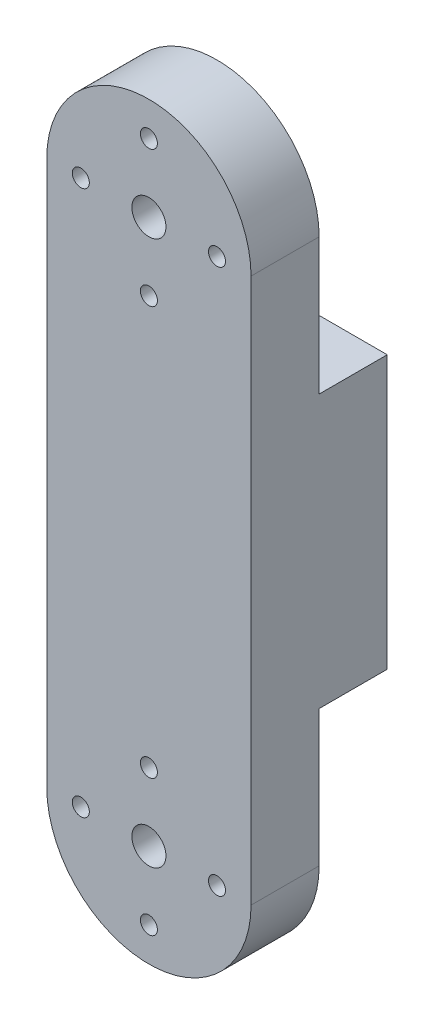
ISO-10303-21;
HEADER;
FILE_DESCRIPTION(('STEP AP214'),'2;1');
FILE_NAME('part.step','',(''),(''),'','','');
FILE_SCHEMA(('AUTOMOTIVE_DESIGN { 1 0 10303 214 1 1 1 1 }'));
ENDSEC;
DATA;
#1=APPLICATION_CONTEXT('core data for automotive mechanical design processes');
#2=APPLICATION_PROTOCOL_DEFINITION('international standard','automotive_design',2000,#1);
#3=PRODUCT_CONTEXT('',#1,'mechanical');
#4=PRODUCT('Part','Part','',(#3));
#5=PRODUCT_RELATED_PRODUCT_CATEGORY('part','',(#4));
#6=PRODUCT_DEFINITION_FORMATION('','',#4);
#7=PRODUCT_DEFINITION_CONTEXT('part definition',#1,'design');
#8=PRODUCT_DEFINITION('design','',#6,#7);
#9=PRODUCT_DEFINITION_SHAPE('','',#8);
#10=(LENGTH_UNIT() NAMED_UNIT(*) SI_UNIT(.MILLI.,.METRE.));
#11=(NAMED_UNIT(*) PLANE_ANGLE_UNIT() SI_UNIT($,.RADIAN.));
#12=(NAMED_UNIT(*) SI_UNIT($,.STERADIAN.) SOLID_ANGLE_UNIT());
#13=UNCERTAINTY_MEASURE_WITH_UNIT(LENGTH_MEASURE(1.E-05),#10,'distance_accuracy_value','');
#14=(GEOMETRIC_REPRESENTATION_CONTEXT(3) GLOBAL_UNCERTAINTY_ASSIGNED_CONTEXT((#13)) GLOBAL_UNIT_ASSIGNED_CONTEXT((#10,
#11,#12)) REPRESENTATION_CONTEXT('',''));
#15=CARTESIAN_POINT('',(0.,0.,0.));
#16=DIRECTION('',(0.,0.,1.));
#17=DIRECTION('',(1.,0.,0.));
#18=AXIS2_PLACEMENT_3D('',#15,#16,#17);
#19=CARTESIAN_POINT('',(0.,50.8,25.4));
#20=DIRECTION('',(0.,0.,-1.));
#21=DIRECTION('',(-1.,0.,0.));
#22=AXIS2_PLACEMENT_3D('',#19,#20,#21);
#23=PLANE('',#22);
#24=CARTESIAN_POINT('',(0.,50.8,25.4));
#25=DIRECTION('',(0.,0.,1.));
#26=DIRECTION('',(-1.,0.,0.));
#27=AXIS2_PLACEMENT_3D('',#24,#25,#26);
#28=CIRCLE('',#27,19.05);
#29=CARTESIAN_POINT('',(19.05,50.8,25.4));
#30=VERTEX_POINT('',#29);
#31=CARTESIAN_POINT('',(-19.05,50.8,25.4));
#32=VERTEX_POINT('',#31);
#33=EDGE_CURVE('E125',#30,#32,#28,.T.);
#34=ORIENTED_EDGE('',*,*,#33,.T.);
#35=DIRECTION('',(0.,-1.,0.));
#36=VECTOR('',#35,1.);
#37=CARTESIAN_POINT('',(-19.05,50.8,25.4));
#38=LINE('',#37,#36);
#39=CARTESIAN_POINT('',(-19.05,-50.8,25.4));
#40=VERTEX_POINT('',#39);
#41=EDGE_CURVE('E118',#32,#40,#38,.T.);
#42=ORIENTED_EDGE('',*,*,#41,.T.);
#43=CARTESIAN_POINT('',(0.,-50.8,25.4));
#44=DIRECTION('',(0.,0.,1.));
#45=DIRECTION('',(1.,0.,0.));
#46=AXIS2_PLACEMENT_3D('',#43,#44,#45);
#47=CIRCLE('',#46,19.05);
#48=CARTESIAN_POINT('',(19.05,-50.8,25.4));
#49=VERTEX_POINT('',#48);
#50=EDGE_CURVE('E124',#40,#49,#47,.T.);
#51=ORIENTED_EDGE('',*,*,#50,.T.);
#52=DIRECTION('',(0.,1.,0.));
#53=VECTOR('',#52,1.);
#54=CARTESIAN_POINT('',(19.05,50.8,25.4));
#55=LINE('',#54,#53);
#56=EDGE_CURVE('E129',#49,#30,#55,.T.);
#57=ORIENTED_EDGE('',*,*,#56,.T.);
#58=EDGE_LOOP('',(#34,#42,#51,#57));
#59=FACE_BOUND('',#58,.T.);
#60=CARTESIAN_POINT('',(0.,50.8,25.4));
#61=DIRECTION('',(0.,0.,1.));
#62=DIRECTION('',(1.,0.,0.));
#63=AXIS2_PLACEMENT_3D('',#60,#61,#62);
#64=CIRCLE('',#63,3.175);
#65=CARTESIAN_POINT('',(3.17499999999998,50.8,25.4));
#66=VERTEX_POINT('',#65);
#67=EDGE_CURVE('E136',#66,#66,#64,.T.);
#68=ORIENTED_EDGE('',*,*,#67,.F.);
#69=EDGE_LOOP('',(#68));
#70=FACE_BOUND('',#69,.T.);
#71=CARTESIAN_POINT('',(0.,-50.8,25.4));
#72=DIRECTION('',(0.,0.,1.));
#73=DIRECTION('',(1.,0.,0.));
#74=AXIS2_PLACEMENT_3D('',#71,#72,#73);
#75=CIRCLE('',#74,3.175);
#76=CARTESIAN_POINT('',(3.17500000000001,-50.8,25.4));
#77=VERTEX_POINT('',#76);
#78=EDGE_CURVE('E228',#77,#77,#75,.T.);
#79=ORIENTED_EDGE('',*,*,#78,.F.);
#80=EDGE_LOOP('',(#79));
#81=FACE_BOUND('',#80,.T.);
#82=CARTESIAN_POINT('',(0.,63.5,25.4));
#83=DIRECTION('',(0.,0.,1.));
#84=DIRECTION('',(1.,0.,0.));
#85=AXIS2_PLACEMENT_3D('',#82,#83,#84);
#86=CIRCLE('',#85,1.5875);
#87=CARTESIAN_POINT('',(1.5875,63.5,25.4));
#88=VERTEX_POINT('',#87);
#89=EDGE_CURVE('E226',#88,#88,#86,.T.);
#90=ORIENTED_EDGE('',*,*,#89,.F.);
#91=EDGE_LOOP('',(#90));
#92=FACE_BOUND('',#91,.T.);
#93=CARTESIAN_POINT('',(-12.7,50.8,25.4));
#94=DIRECTION('',(0.,0.,1.));
#95=DIRECTION('',(1.,0.,0.));
#96=AXIS2_PLACEMENT_3D('',#93,#94,#95);
#97=CIRCLE('',#96,1.5875);
#98=CARTESIAN_POINT('',(-11.1125,50.8,25.4));
#99=VERTEX_POINT('',#98);
#100=EDGE_CURVE('E223',#99,#99,#97,.T.);
#101=ORIENTED_EDGE('',*,*,#100,.F.);
#102=EDGE_LOOP('',(#101));
#103=FACE_BOUND('',#102,.T.);
#104=CARTESIAN_POINT('',(0.,38.1,25.4));
#105=DIRECTION('',(0.,0.,1.));
#106=DIRECTION('',(1.,0.,0.));
#107=AXIS2_PLACEMENT_3D('',#104,#105,#106);
#108=CIRCLE('',#107,1.5875);
#109=CARTESIAN_POINT('',(1.5875,38.1,25.4));
#110=VERTEX_POINT('',#109);
#111=EDGE_CURVE('E220',#110,#110,#108,.T.);
#112=ORIENTED_EDGE('',*,*,#111,.F.);
#113=EDGE_LOOP('',(#112));
#114=FACE_BOUND('',#113,.T.);
#115=CARTESIAN_POINT('',(12.7,50.8,25.4));
#116=DIRECTION('',(0.,0.,1.));
#117=DIRECTION('',(1.,0.,0.));
#118=AXIS2_PLACEMENT_3D('',#115,#116,#117);
#119=CIRCLE('',#118,1.5875);
#120=CARTESIAN_POINT('',(14.2875,50.8,25.4));
#121=VERTEX_POINT('',#120);
#122=EDGE_CURVE('E217',#121,#121,#119,.T.);
#123=ORIENTED_EDGE('',*,*,#122,.F.);
#124=EDGE_LOOP('',(#123));
#125=FACE_BOUND('',#124,.T.);
#126=CARTESIAN_POINT('',(-12.7,-50.8,25.4));
#127=DIRECTION('',(0.,0.,1.));
#128=DIRECTION('',(1.,0.,0.));
#129=AXIS2_PLACEMENT_3D('',#126,#127,#128);
#130=CIRCLE('',#129,1.5875);
#131=CARTESIAN_POINT('',(-11.1125,-50.8,25.4));
#132=VERTEX_POINT('',#131);
#133=EDGE_CURVE('E214',#132,#132,#130,.T.);
#134=ORIENTED_EDGE('',*,*,#133,.F.);
#135=EDGE_LOOP('',(#134));
#136=FACE_BOUND('',#135,.T.);
#137=CARTESIAN_POINT('',(0.,-38.1,25.4));
#138=DIRECTION('',(0.,0.,1.));
#139=DIRECTION('',(1.,0.,0.));
#140=AXIS2_PLACEMENT_3D('',#137,#138,#139);
#141=CIRCLE('',#140,1.5875);
#142=CARTESIAN_POINT('',(1.5875,-38.1,25.4));
#143=VERTEX_POINT('',#142);
#144=EDGE_CURVE('E211',#143,#143,#141,.T.);
#145=ORIENTED_EDGE('',*,*,#144,.F.);
#146=EDGE_LOOP('',(#145));
#147=FACE_BOUND('',#146,.T.);
#148=CARTESIAN_POINT('',(12.7,-50.8,25.4));
#149=DIRECTION('',(0.,0.,1.));
#150=DIRECTION('',(1.,0.,0.));
#151=AXIS2_PLACEMENT_3D('',#148,#149,#150);
#152=CIRCLE('',#151,1.5875);
#153=CARTESIAN_POINT('',(14.2875,-50.8,25.4));
#154=VERTEX_POINT('',#153);
#155=EDGE_CURVE('E208',#154,#154,#152,.T.);
#156=ORIENTED_EDGE('',*,*,#155,.F.);
#157=EDGE_LOOP('',(#156));
#158=FACE_BOUND('',#157,.T.);
#159=CARTESIAN_POINT('',(0.,-63.5,25.4));
#160=DIRECTION('',(0.,0.,1.));
#161=DIRECTION('',(1.,0.,0.));
#162=AXIS2_PLACEMENT_3D('',#159,#160,#161);
#163=CIRCLE('',#162,1.5875);
#164=CARTESIAN_POINT('',(1.58750000000001,-63.5,25.4));
#165=VERTEX_POINT('',#164);
#166=EDGE_CURVE('E104',#165,#165,#163,.T.);
#167=ORIENTED_EDGE('',*,*,#166,.F.);
#168=EDGE_LOOP('',(#167));
#169=FACE_BOUND('',#168,.T.);
#170=ADVANCED_FACE('F33',(#59,#70,#81,#92,#103,#114,#125,#136,#147,#158,#169),#23,.F.);
#171=CARTESIAN_POINT('',(0.,50.8,0.));
#172=DIRECTION('',(0.,0.,-1.));
#173=DIRECTION('',(-1.,0.,0.));
#174=AXIS2_PLACEMENT_3D('',#171,#172,#173);
#175=PLANE('',#174);
#176=DIRECTION('',(1.,0.,0.));
#177=VECTOR('',#176,1.);
#178=CARTESIAN_POINT('',(-19.051,25.4,0.));
#179=LINE('',#178,#177);
#180=CARTESIAN_POINT('',(-19.05,25.4,0.));
#181=VERTEX_POINT('',#180);
#182=CARTESIAN_POINT('',(19.05,25.4,0.));
#183=VERTEX_POINT('',#182);
#184=EDGE_CURVE('E105',#181,#183,#179,.T.);
#185=ORIENTED_EDGE('',*,*,#184,.T.);
#186=DIRECTION('',(0.,1.,0.));
#187=VECTOR('',#186,1.);
#188=CARTESIAN_POINT('',(19.05,50.8,0.));
#189=LINE('',#188,#187);
#190=CARTESIAN_POINT('',(19.05,-25.4,0.));
#191=VERTEX_POINT('',#190);
#192=EDGE_CURVE('E130',#191,#183,#189,.T.);
#193=ORIENTED_EDGE('',*,*,#192,.F.);
#194=DIRECTION('',(1.,0.,0.));
#195=VECTOR('',#194,1.);
#196=CARTESIAN_POINT('',(-19.051,-25.4,0.));
#197=LINE('',#196,#195);
#198=CARTESIAN_POINT('',(-19.05,-25.4,0.));
#199=VERTEX_POINT('',#198);
#200=EDGE_CURVE('E56',#199,#191,#197,.T.);
#201=ORIENTED_EDGE('',*,*,#200,.F.);
#202=DIRECTION('',(0.,-1.,0.));
#203=VECTOR('',#202,1.);
#204=CARTESIAN_POINT('',(-19.05,50.8,0.));
#205=LINE('',#204,#203);
#206=EDGE_CURVE('E133',#181,#199,#205,.T.);
#207=ORIENTED_EDGE('',*,*,#206,.F.);
#208=EDGE_LOOP('',(#185,#193,#201,#207));
#209=FACE_BOUND('',#208,.T.);
#210=ADVANCED_FACE('F238',(#209),#175,.T.);
#211=CARTESIAN_POINT('',(0.,50.8,25.4));
#212=DIRECTION('',(0.,0.,-1.));
#213=DIRECTION('',(-1.,0.,0.));
#214=AXIS2_PLACEMENT_3D('',#211,#212,#213);
#215=CYLINDRICAL_SURFACE('',#214,19.05);
#216=DIRECTION('',(0.,0.,-1.));
#217=VECTOR('',#216,1.);
#218=CARTESIAN_POINT('',(19.05,50.8,25.4));
#219=LINE('',#218,#217);
#220=CARTESIAN_POINT('',(19.05,50.8,12.7));
#221=VERTEX_POINT('',#220);
#222=EDGE_CURVE('E112',#30,#221,#219,.T.);
#223=ORIENTED_EDGE('',*,*,#222,.T.);
#224=CARTESIAN_POINT('',(0.,50.8,12.7));
#225=DIRECTION('',(0.,0.,1.));
#226=DIRECTION('',(0.,-1.,0.));
#227=AXIS2_PLACEMENT_3D('',#224,#225,#226);
#228=CIRCLE('',#227,19.05);
#229=CARTESIAN_POINT('',(-19.05,50.8,12.7));
#230=VERTEX_POINT('',#229);
#231=EDGE_CURVE('E48',#230,#221,#228,.F.);
#232=ORIENTED_EDGE('',*,*,#231,.F.);
#233=DIRECTION('',(0.,0.,-1.));
#234=VECTOR('',#233,1.);
#235=CARTESIAN_POINT('',(-19.05,50.8,25.4));
#236=LINE('',#235,#234);
#237=EDGE_CURVE('E11',#32,#230,#236,.T.);
#238=ORIENTED_EDGE('',*,*,#237,.F.);
#239=ORIENTED_EDGE('',*,*,#33,.F.);
#240=EDGE_LOOP('',(#223,#232,#238,#239));
#241=FACE_BOUND('',#240,.T.);
#242=ADVANCED_FACE('F35',(#241),#215,.T.);
#243=CARTESIAN_POINT('',(-19.05,50.8,25.4));
#244=DIRECTION('',(1.,0.,0.));
#245=DIRECTION('',(0.,0.,-1.));
#246=AXIS2_PLACEMENT_3D('',#243,#244,#245);
#247=PLANE('',#246);
#248=DIRECTION('',(0.,1.,0.));
#249=VECTOR('',#248,1.);
#250=CARTESIAN_POINT('',(-19.05,69.85,12.7));
#251=LINE('',#250,#249);
#252=CARTESIAN_POINT('',(-19.05,25.4,12.7));
#253=VERTEX_POINT('',#252);
#254=EDGE_CURVE('E99',#253,#230,#251,.T.);
#255=ORIENTED_EDGE('',*,*,#254,.F.);
#256=DIRECTION('',(0.,0.,1.));
#257=VECTOR('',#256,1.);
#258=CARTESIAN_POINT('',(-19.05,25.4,0.));
#259=LINE('',#258,#257);
#260=EDGE_CURVE('E157',#181,#253,#259,.T.);
#261=ORIENTED_EDGE('',*,*,#260,.F.);
#262=ORIENTED_EDGE('',*,*,#206,.T.);
#263=DIRECTION('',(0.,0.,-1.));
#264=VECTOR('',#263,1.);
#265=CARTESIAN_POINT('',(-19.05,-25.4,12.7));
#266=LINE('',#265,#264);
#267=CARTESIAN_POINT('',(-19.05,-25.4,12.7));
#268=VERTEX_POINT('',#267);
#269=EDGE_CURVE('E195',#268,#199,#266,.T.);
#270=ORIENTED_EDGE('',*,*,#269,.F.);
#271=DIRECTION('',(0.,1.,0.));
#272=VECTOR('',#271,1.);
#273=CARTESIAN_POINT('',(-19.05,-25.4,12.7));
#274=LINE('',#273,#272);
#275=CARTESIAN_POINT('',(-19.05,-50.8,12.7));
#276=VERTEX_POINT('',#275);
#277=EDGE_CURVE('E197',#276,#268,#274,.T.);
#278=ORIENTED_EDGE('',*,*,#277,.F.);
#279=DIRECTION('',(0.,0.,-1.));
#280=VECTOR('',#279,1.);
#281=CARTESIAN_POINT('',(-19.05,-50.8,25.4));
#282=LINE('',#281,#280);
#283=EDGE_CURVE('E41',#40,#276,#282,.T.);
#284=ORIENTED_EDGE('',*,*,#283,.F.);
#285=ORIENTED_EDGE('',*,*,#41,.F.);
#286=ORIENTED_EDGE('',*,*,#237,.T.);
#287=EDGE_LOOP('',(#255,#261,#262,#270,#278,#284,#285,#286));
#288=FACE_BOUND('',#287,.T.);
#289=ADVANCED_FACE('F116',(#288),#247,.F.);
#290=CARTESIAN_POINT('',(0.,-50.8,25.4));
#291=DIRECTION('',(0.,0.,-1.));
#292=DIRECTION('',(-1.,0.,0.));
#293=AXIS2_PLACEMENT_3D('',#290,#291,#292);
#294=CYLINDRICAL_SURFACE('',#293,19.05);
#295=ORIENTED_EDGE('',*,*,#283,.T.);
#296=CARTESIAN_POINT('',(0.,-50.8,12.7));
#297=DIRECTION('',(0.,0.,1.));
#298=DIRECTION('',(0.,-1.,0.));
#299=AXIS2_PLACEMENT_3D('',#296,#297,#298);
#300=CIRCLE('',#299,19.05);
#301=CARTESIAN_POINT('',(19.05,-50.8,12.7));
#302=VERTEX_POINT('',#301);
#303=EDGE_CURVE('E150',#302,#276,#300,.F.);
#304=ORIENTED_EDGE('',*,*,#303,.F.);
#305=DIRECTION('',(0.,0.,-1.));
#306=VECTOR('',#305,1.);
#307=CARTESIAN_POINT('',(19.05,-50.8,25.4));
#308=LINE('',#307,#306);
#309=EDGE_CURVE('E144',#49,#302,#308,.T.);
#310=ORIENTED_EDGE('',*,*,#309,.F.);
#311=ORIENTED_EDGE('',*,*,#50,.F.);
#312=EDGE_LOOP('',(#295,#304,#310,#311));
#313=FACE_BOUND('',#312,.T.);
#314=ADVANCED_FACE('F148',(#313),#294,.T.);
#315=CARTESIAN_POINT('',(19.05,50.8,25.4));
#316=DIRECTION('',(-1.,0.,0.));
#317=DIRECTION('',(0.,0.,1.));
#318=AXIS2_PLACEMENT_3D('',#315,#316,#317);
#319=PLANE('',#318);
#320=ORIENTED_EDGE('',*,*,#192,.T.);
#321=DIRECTION('',(0.,0.,-1.));
#322=VECTOR('',#321,1.);
#323=CARTESIAN_POINT('',(19.05,25.4,0.));
#324=LINE('',#323,#322);
#325=CARTESIAN_POINT('',(19.05,25.4,12.7));
#326=VERTEX_POINT('',#325);
#327=EDGE_CURVE('E156',#326,#183,#324,.T.);
#328=ORIENTED_EDGE('',*,*,#327,.F.);
#329=DIRECTION('',(0.,-1.,0.));
#330=VECTOR('',#329,1.);
#331=CARTESIAN_POINT('',(19.05,69.85,12.7));
#332=LINE('',#331,#330);
#333=EDGE_CURVE('E155',#221,#326,#332,.T.);
#334=ORIENTED_EDGE('',*,*,#333,.F.);
#335=ORIENTED_EDGE('',*,*,#222,.F.);
#336=ORIENTED_EDGE('',*,*,#56,.F.);
#337=ORIENTED_EDGE('',*,*,#309,.T.);
#338=DIRECTION('',(0.,-1.,0.));
#339=VECTOR('',#338,1.);
#340=CARTESIAN_POINT('',(19.05,-25.4,12.7));
#341=LINE('',#340,#339);
#342=CARTESIAN_POINT('',(19.05,-25.4,12.7));
#343=VERTEX_POINT('',#342);
#344=EDGE_CURVE('E202',#343,#302,#341,.T.);
#345=ORIENTED_EDGE('',*,*,#344,.F.);
#346=DIRECTION('',(0.,0.,1.));
#347=VECTOR('',#346,1.);
#348=CARTESIAN_POINT('',(19.05,-25.4,12.7));
#349=LINE('',#348,#347);
#350=EDGE_CURVE('E200',#191,#343,#349,.T.);
#351=ORIENTED_EDGE('',*,*,#350,.F.);
#352=EDGE_LOOP('',(#320,#328,#334,#335,#336,#337,#345,#351));
#353=FACE_BOUND('',#352,.T.);
#354=ADVANCED_FACE('F153',(#353),#319,.F.);
#355=CARTESIAN_POINT('',(0.,50.8,25.4));
#356=DIRECTION('',(0.,0.,-1.));
#357=DIRECTION('',(-1.,0.,0.));
#358=AXIS2_PLACEMENT_3D('',#355,#356,#357);
#359=CYLINDRICAL_SURFACE('',#358,3.175);
#360=CARTESIAN_POINT('',(0.,50.8,12.7));
#361=DIRECTION('',(0.,0.,1.));
#362=DIRECTION('',(0.,-1.,0.));
#363=AXIS2_PLACEMENT_3D('',#360,#361,#362);
#364=CIRCLE('',#363,3.175);
#365=CARTESIAN_POINT('',(0.,47.625,12.7));
#366=VERTEX_POINT('',#365);
#367=EDGE_CURVE('E160',#366,#366,#364,.F.);
#368=ORIENTED_EDGE('',*,*,#367,.T.);
#369=EDGE_LOOP('',(#368));
#370=FACE_BOUND('',#369,.T.);
#371=ORIENTED_EDGE('',*,*,#67,.T.);
#372=EDGE_LOOP('',(#371));
#373=FACE_BOUND('',#372,.T.);
#374=ADVANCED_FACE('F235',(#370,#373),#359,.F.);
#375=CARTESIAN_POINT('',(0.,-50.8,25.4));
#376=DIRECTION('',(0.,0.,-1.));
#377=DIRECTION('',(-1.,0.,0.));
#378=AXIS2_PLACEMENT_3D('',#375,#376,#377);
#379=CYLINDRICAL_SURFACE('',#378,3.175);
#380=CARTESIAN_POINT('',(0.,-50.8,12.7));
#381=DIRECTION('',(0.,0.,1.));
#382=DIRECTION('',(0.,-1.,0.));
#383=AXIS2_PLACEMENT_3D('',#380,#381,#382);
#384=CIRCLE('',#383,3.175);
#385=CARTESIAN_POINT('',(0.,-53.975,12.7));
#386=VERTEX_POINT('',#385);
#387=EDGE_CURVE('E192',#386,#386,#384,.F.);
#388=ORIENTED_EDGE('',*,*,#387,.T.);
#389=EDGE_LOOP('',(#388));
#390=FACE_BOUND('',#389,.T.);
#391=ORIENTED_EDGE('',*,*,#78,.T.);
#392=EDGE_LOOP('',(#391));
#393=FACE_BOUND('',#392,.T.);
#394=ADVANCED_FACE('F297',(#390,#393),#379,.F.);
#395=CARTESIAN_POINT('',(0.,63.5,25.4));
#396=DIRECTION('',(0.,0.,-1.));
#397=DIRECTION('',(-1.,0.,0.));
#398=AXIS2_PLACEMENT_3D('',#395,#396,#397);
#399=CYLINDRICAL_SURFACE('',#398,1.5875);
#400=CARTESIAN_POINT('',(0.,63.5,12.7));
#401=DIRECTION('',(0.,0.,1.));
#402=DIRECTION('',(0.,-1.,0.));
#403=AXIS2_PLACEMENT_3D('',#400,#401,#402);
#404=CIRCLE('',#403,1.5875);
#405=CARTESIAN_POINT('',(0.,61.9125,12.7));
#406=VERTEX_POINT('',#405);
#407=EDGE_CURVE('E174',#406,#406,#404,.F.);
#408=ORIENTED_EDGE('',*,*,#407,.T.);
#409=EDGE_LOOP('',(#408));
#410=FACE_BOUND('',#409,.T.);
#411=ORIENTED_EDGE('',*,*,#89,.T.);
#412=EDGE_LOOP('',(#411));
#413=FACE_BOUND('',#412,.T.);
#414=ADVANCED_FACE('F293',(#410,#413),#399,.F.);
#415=CARTESIAN_POINT('',(-12.7,50.8,25.4));
#416=DIRECTION('',(0.,0.,-1.));
#417=DIRECTION('',(-1.,0.,0.));
#418=AXIS2_PLACEMENT_3D('',#415,#416,#417);
#419=CYLINDRICAL_SURFACE('',#418,1.5875);
#420=CARTESIAN_POINT('',(-12.7,50.8,12.7));
#421=DIRECTION('',(0.,0.,1.));
#422=DIRECTION('',(0.,-1.,0.));
#423=AXIS2_PLACEMENT_3D('',#420,#421,#422);
#424=CIRCLE('',#423,1.5875);
#425=CARTESIAN_POINT('',(-12.7,49.2125,12.7));
#426=VERTEX_POINT('',#425);
#427=EDGE_CURVE('E171',#426,#426,#424,.F.);
#428=ORIENTED_EDGE('',*,*,#427,.T.);
#429=EDGE_LOOP('',(#428));
#430=FACE_BOUND('',#429,.T.);
#431=ORIENTED_EDGE('',*,*,#100,.T.);
#432=EDGE_LOOP('',(#431));
#433=FACE_BOUND('',#432,.T.);
#434=ADVANCED_FACE('F289',(#430,#433),#419,.F.);
#435=CARTESIAN_POINT('',(0.,38.1,25.4));
#436=DIRECTION('',(0.,0.,-1.));
#437=DIRECTION('',(-1.,0.,0.));
#438=AXIS2_PLACEMENT_3D('',#435,#436,#437);
#439=CYLINDRICAL_SURFACE('',#438,1.5875);
#440=CARTESIAN_POINT('',(0.,38.1,12.7));
#441=DIRECTION('',(0.,0.,1.));
#442=DIRECTION('',(0.,-1.,0.));
#443=AXIS2_PLACEMENT_3D('',#440,#441,#442);
#444=CIRCLE('',#443,1.5875);
#445=CARTESIAN_POINT('',(0.,36.5125,12.7));
#446=VERTEX_POINT('',#445);
#447=EDGE_CURVE('E168',#446,#446,#444,.F.);
#448=ORIENTED_EDGE('',*,*,#447,.T.);
#449=EDGE_LOOP('',(#448));
#450=FACE_BOUND('',#449,.T.);
#451=ORIENTED_EDGE('',*,*,#111,.T.);
#452=EDGE_LOOP('',(#451));
#453=FACE_BOUND('',#452,.T.);
#454=ADVANCED_FACE('F285',(#450,#453),#439,.F.);
#455=CARTESIAN_POINT('',(12.7,50.8,25.4));
#456=DIRECTION('',(0.,0.,-1.));
#457=DIRECTION('',(-1.,0.,0.));
#458=AXIS2_PLACEMENT_3D('',#455,#456,#457);
#459=CYLINDRICAL_SURFACE('',#458,1.5875);
#460=CARTESIAN_POINT('',(12.7,50.8,12.7));
#461=DIRECTION('',(0.,0.,1.));
#462=DIRECTION('',(0.,-1.,0.));
#463=AXIS2_PLACEMENT_3D('',#460,#461,#462);
#464=CIRCLE('',#463,1.5875);
#465=CARTESIAN_POINT('',(12.7,49.2125,12.7));
#466=VERTEX_POINT('',#465);
#467=EDGE_CURVE('E113',#466,#466,#464,.F.);
#468=ORIENTED_EDGE('',*,*,#467,.T.);
#469=EDGE_LOOP('',(#468));
#470=FACE_BOUND('',#469,.T.);
#471=ORIENTED_EDGE('',*,*,#122,.T.);
#472=EDGE_LOOP('',(#471));
#473=FACE_BOUND('',#472,.T.);
#474=ADVANCED_FACE('F281',(#470,#473),#459,.F.);
#475=CARTESIAN_POINT('',(-12.7,-50.8,25.4));
#476=DIRECTION('',(0.,0.,-1.));
#477=DIRECTION('',(-1.,0.,0.));
#478=AXIS2_PLACEMENT_3D('',#475,#476,#477);
#479=CYLINDRICAL_SURFACE('',#478,1.5875);
#480=CARTESIAN_POINT('',(-12.7,-50.8,12.7));
#481=DIRECTION('',(0.,0.,1.));
#482=DIRECTION('',(0.,-1.,0.));
#483=AXIS2_PLACEMENT_3D('',#480,#481,#482);
#484=CIRCLE('',#483,1.5875);
#485=CARTESIAN_POINT('',(-12.7,-52.3875,12.7));
#486=VERTEX_POINT('',#485);
#487=EDGE_CURVE('E189',#486,#486,#484,.F.);
#488=ORIENTED_EDGE('',*,*,#487,.T.);
#489=EDGE_LOOP('',(#488));
#490=FACE_BOUND('',#489,.T.);
#491=ORIENTED_EDGE('',*,*,#133,.T.);
#492=EDGE_LOOP('',(#491));
#493=FACE_BOUND('',#492,.T.);
#494=ADVANCED_FACE('F277',(#490,#493),#479,.F.);
#495=CARTESIAN_POINT('',(0.,-38.1,25.4));
#496=DIRECTION('',(0.,0.,-1.));
#497=DIRECTION('',(-1.,0.,0.));
#498=AXIS2_PLACEMENT_3D('',#495,#496,#497);
#499=CYLINDRICAL_SURFACE('',#498,1.5875);
#500=CARTESIAN_POINT('',(0.,-38.1,12.7));
#501=DIRECTION('',(0.,0.,1.));
#502=DIRECTION('',(0.,-1.,0.));
#503=AXIS2_PLACEMENT_3D('',#500,#501,#502);
#504=CIRCLE('',#503,1.5875);
#505=CARTESIAN_POINT('',(0.,-39.6875,12.7));
#506=VERTEX_POINT('',#505);
#507=EDGE_CURVE('E186',#506,#506,#504,.F.);
#508=ORIENTED_EDGE('',*,*,#507,.T.);
#509=EDGE_LOOP('',(#508));
#510=FACE_BOUND('',#509,.T.);
#511=ORIENTED_EDGE('',*,*,#144,.T.);
#512=EDGE_LOOP('',(#511));
#513=FACE_BOUND('',#512,.T.);
#514=ADVANCED_FACE('F270',(#510,#513),#499,.F.);
#515=CARTESIAN_POINT('',(12.7,-50.8,25.4));
#516=DIRECTION('',(0.,0.,-1.));
#517=DIRECTION('',(-1.,0.,0.));
#518=AXIS2_PLACEMENT_3D('',#515,#516,#517);
#519=CYLINDRICAL_SURFACE('',#518,1.5875);
#520=CARTESIAN_POINT('',(12.7,-50.8,12.7));
#521=DIRECTION('',(0.,0.,1.));
#522=DIRECTION('',(0.,-1.,0.));
#523=AXIS2_PLACEMENT_3D('',#520,#521,#522);
#524=CIRCLE('',#523,1.5875);
#525=CARTESIAN_POINT('',(12.7,-52.3875,12.7));
#526=VERTEX_POINT('',#525);
#527=EDGE_CURVE('E183',#526,#526,#524,.F.);
#528=ORIENTED_EDGE('',*,*,#527,.T.);
#529=EDGE_LOOP('',(#528));
#530=FACE_BOUND('',#529,.T.);
#531=ORIENTED_EDGE('',*,*,#155,.T.);
#532=EDGE_LOOP('',(#531));
#533=FACE_BOUND('',#532,.T.);
#534=ADVANCED_FACE('F260',(#530,#533),#519,.F.);
#535=CARTESIAN_POINT('',(0.,-63.5,25.4));
#536=DIRECTION('',(0.,0.,-1.));
#537=DIRECTION('',(-1.,0.,0.));
#538=AXIS2_PLACEMENT_3D('',#535,#536,#537);
#539=CYLINDRICAL_SURFACE('',#538,1.5875);
#540=CARTESIAN_POINT('',(0.,-63.5,12.7));
#541=DIRECTION('',(0.,0.,1.));
#542=DIRECTION('',(0.,-1.,0.));
#543=AXIS2_PLACEMENT_3D('',#540,#541,#542);
#544=CIRCLE('',#543,1.5875);
#545=CARTESIAN_POINT('',(0.,-65.0875,12.7));
#546=VERTEX_POINT('',#545);
#547=EDGE_CURVE('E180',#546,#546,#544,.F.);
#548=ORIENTED_EDGE('',*,*,#547,.T.);
#549=EDGE_LOOP('',(#548));
#550=FACE_BOUND('',#549,.T.);
#551=ORIENTED_EDGE('',*,*,#166,.T.);
#552=EDGE_LOOP('',(#551));
#553=FACE_BOUND('',#552,.T.);
#554=ADVANCED_FACE('F257',(#550,#553),#539,.F.);
#555=CARTESIAN_POINT('',(-19.051,-25.4,12.7));
#556=DIRECTION('',(0.,0.,1.));
#557=DIRECTION('',(0.,-1.,0.));
#558=AXIS2_PLACEMENT_3D('',#555,#556,#557);
#559=PLANE('',#558);
#560=ORIENTED_EDGE('',*,*,#387,.F.);
#561=EDGE_LOOP('',(#560));
#562=FACE_BOUND('',#561,.T.);
#563=ORIENTED_EDGE('',*,*,#487,.F.);
#564=EDGE_LOOP('',(#563));
#565=FACE_BOUND('',#564,.T.);
#566=ORIENTED_EDGE('',*,*,#507,.F.);
#567=EDGE_LOOP('',(#566));
#568=FACE_BOUND('',#567,.T.);
#569=ORIENTED_EDGE('',*,*,#527,.F.);
#570=EDGE_LOOP('',(#569));
#571=FACE_BOUND('',#570,.T.);
#572=ORIENTED_EDGE('',*,*,#547,.F.);
#573=EDGE_LOOP('',(#572));
#574=FACE_BOUND('',#573,.T.);
#575=ORIENTED_EDGE('',*,*,#277,.T.);
#576=DIRECTION('',(1.,0.,0.));
#577=VECTOR('',#576,1.);
#578=CARTESIAN_POINT('',(-19.051,-25.4,12.7));
#579=LINE('',#578,#577);
#580=EDGE_CURVE('E114',#268,#343,#579,.T.);
#581=ORIENTED_EDGE('',*,*,#580,.T.);
#582=ORIENTED_EDGE('',*,*,#344,.T.);
#583=ORIENTED_EDGE('',*,*,#303,.T.);
#584=EDGE_LOOP('',(#575,#581,#582,#583));
#585=FACE_BOUND('',#584,.T.);
#586=ADVANCED_FACE('F259',(#562,#565,#568,#571,#574,#585),#559,.F.);
#587=CARTESIAN_POINT('',(-19.051,-25.4,12.7));
#588=DIRECTION('',(0.,1.,0.));
#589=DIRECTION('',(0.,0.,1.));
#590=AXIS2_PLACEMENT_3D('',#587,#588,#589);
#591=PLANE('',#590);
#592=ORIENTED_EDGE('',*,*,#269,.T.);
#593=ORIENTED_EDGE('',*,*,#200,.T.);
#594=ORIENTED_EDGE('',*,*,#350,.T.);
#595=ORIENTED_EDGE('',*,*,#580,.F.);
#596=EDGE_LOOP('',(#592,#593,#594,#595));
#597=FACE_BOUND('',#596,.T.);
#598=ADVANCED_FACE('F267',(#597),#591,.F.);
#599=CARTESIAN_POINT('',(-19.051,25.4,0.));
#600=DIRECTION('',(0.,-1.,0.));
#601=DIRECTION('',(0.,0.,-1.));
#602=AXIS2_PLACEMENT_3D('',#599,#600,#601);
#603=PLANE('',#602);
#604=ORIENTED_EDGE('',*,*,#260,.T.);
#605=DIRECTION('',(1.,0.,0.));
#606=VECTOR('',#605,1.);
#607=CARTESIAN_POINT('',(-19.051,25.4,12.7));
#608=LINE('',#607,#606);
#609=EDGE_CURVE('E101',#253,#326,#608,.T.);
#610=ORIENTED_EDGE('',*,*,#609,.T.);
#611=ORIENTED_EDGE('',*,*,#327,.T.);
#612=ORIENTED_EDGE('',*,*,#184,.F.);
#613=EDGE_LOOP('',(#604,#610,#611,#612));
#614=FACE_BOUND('',#613,.T.);
#615=ADVANCED_FACE('F407',(#614),#603,.F.);
#616=CARTESIAN_POINT('',(-19.051,69.85,12.7));
#617=DIRECTION('',(0.,0.,1.));
#618=DIRECTION('',(0.,-1.,0.));
#619=AXIS2_PLACEMENT_3D('',#616,#617,#618);
#620=PLANE('',#619);
#621=ORIENTED_EDGE('',*,*,#367,.F.);
#622=EDGE_LOOP('',(#621));
#623=FACE_BOUND('',#622,.T.);
#624=ORIENTED_EDGE('',*,*,#407,.F.);
#625=EDGE_LOOP('',(#624));
#626=FACE_BOUND('',#625,.T.);
#627=ORIENTED_EDGE('',*,*,#427,.F.);
#628=EDGE_LOOP('',(#627));
#629=FACE_BOUND('',#628,.T.);
#630=ORIENTED_EDGE('',*,*,#447,.F.);
#631=EDGE_LOOP('',(#630));
#632=FACE_BOUND('',#631,.T.);
#633=ORIENTED_EDGE('',*,*,#467,.F.);
#634=EDGE_LOOP('',(#633));
#635=FACE_BOUND('',#634,.T.);
#636=ORIENTED_EDGE('',*,*,#231,.T.);
#637=ORIENTED_EDGE('',*,*,#333,.T.);
#638=ORIENTED_EDGE('',*,*,#609,.F.);
#639=ORIENTED_EDGE('',*,*,#254,.T.);
#640=EDGE_LOOP('',(#636,#637,#638,#639));
#641=FACE_BOUND('',#640,.T.);
#642=ADVANCED_FACE('F100',(#623,#626,#629,#632,#635,#641),#620,.F.);
#643=CLOSED_SHELL('',(#170,#210,#242,#289,#314,#354,#374,#394,#414,#434,#454,#474,#494,#514,
#534,#554,#586,#598,#615,#642));
#644=MANIFOLD_SOLID_BREP('B2',#643);
#645=ADVANCED_BREP_SHAPE_REPRESENTATION('',(#18,#644),#14);
#646=SHAPE_DEFINITION_REPRESENTATION(#9,#645);
ENDSEC;
END-ISO-10303-21;
